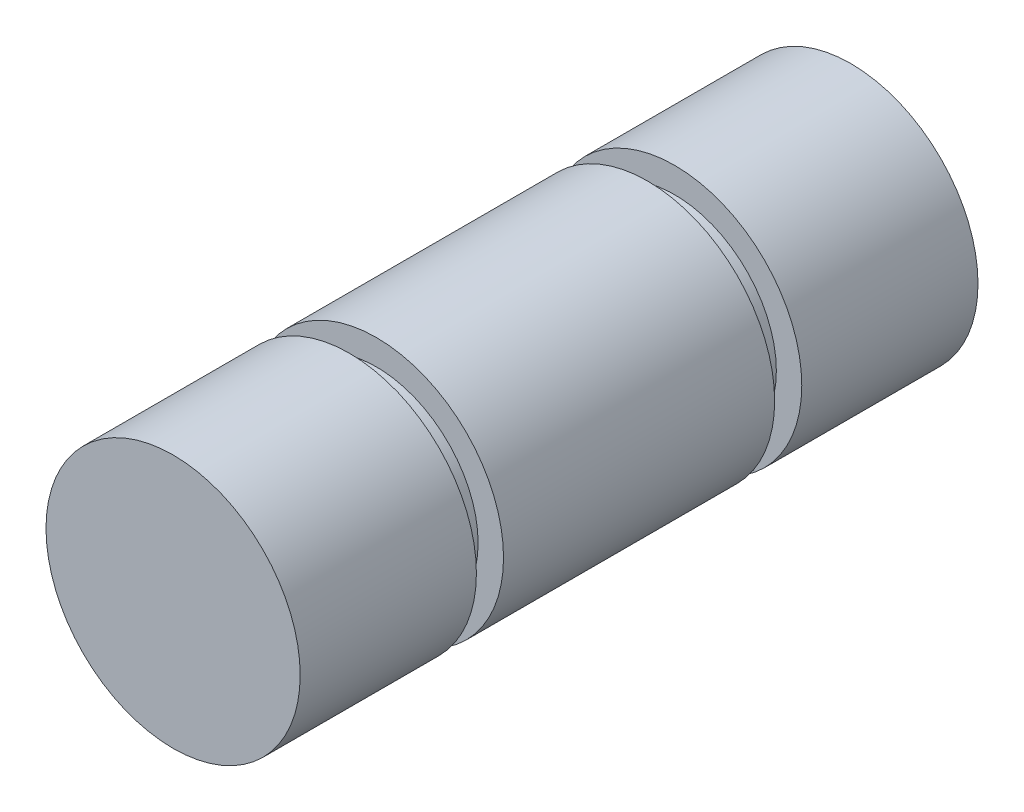
ISO-10303-21;
HEADER;
FILE_DESCRIPTION(('STEP AP214'),'2;1');
FILE_NAME('part.step','',(''),(''),'','','');
FILE_SCHEMA(('AUTOMOTIVE_DESIGN { 1 0 10303 214 1 1 1 1 }'));
ENDSEC;
DATA;
#1=APPLICATION_CONTEXT('core data for automotive mechanical design processes');
#2=APPLICATION_PROTOCOL_DEFINITION('international standard','automotive_design',2000,#1);
#3=PRODUCT_CONTEXT('',#1,'mechanical');
#4=PRODUCT('Part','Part','',(#3));
#5=PRODUCT_RELATED_PRODUCT_CATEGORY('part','',(#4));
#6=PRODUCT_DEFINITION_FORMATION('','',#4);
#7=PRODUCT_DEFINITION_CONTEXT('part definition',#1,'design');
#8=PRODUCT_DEFINITION('design','',#6,#7);
#9=PRODUCT_DEFINITION_SHAPE('','',#8);
#10=(LENGTH_UNIT() NAMED_UNIT(*) SI_UNIT(.MILLI.,.METRE.));
#11=(NAMED_UNIT(*) PLANE_ANGLE_UNIT() SI_UNIT($,.RADIAN.));
#12=(NAMED_UNIT(*) SI_UNIT($,.STERADIAN.) SOLID_ANGLE_UNIT());
#13=UNCERTAINTY_MEASURE_WITH_UNIT(LENGTH_MEASURE(1.E-05),#10,'distance_accuracy_value','');
#14=(GEOMETRIC_REPRESENTATION_CONTEXT(3) GLOBAL_UNCERTAINTY_ASSIGNED_CONTEXT((#13)) GLOBAL_UNIT_ASSIGNED_CONTEXT((#10,
#11,#12)) REPRESENTATION_CONTEXT('',''));
#15=CARTESIAN_POINT('',(0.,0.,0.));
#16=DIRECTION('',(0.,0.,1.));
#17=DIRECTION('',(1.,0.,0.));
#18=AXIS2_PLACEMENT_3D('',#15,#16,#17);
#19=CARTESIAN_POINT('',(0.,0.,12.7));
#20=DIRECTION('',(0.,0.,-1.));
#21=DIRECTION('',(-1.,0.,0.));
#22=AXIS2_PLACEMENT_3D('',#19,#20,#21);
#23=CYLINDRICAL_SURFACE('',#22,4.7625);
#24=CARTESIAN_POINT('',(0.,0.,-6.096));
#25=DIRECTION('',(0.,0.,1.));
#26=DIRECTION('',(1.,0.,0.));
#27=AXIS2_PLACEMENT_3D('',#24,#25,#26);
#28=CIRCLE('',#27,4.7625);
#29=CARTESIAN_POINT('',(4.7625,0.,-6.096));
#30=VERTEX_POINT('',#29);
#31=EDGE_CURVE('E56',#30,#30,#28,.T.);
#32=ORIENTED_EDGE('',*,*,#31,.F.);
#33=EDGE_LOOP('',(#32));
#34=FACE_BOUND('',#33,.T.);
#35=CARTESIAN_POINT('',(0.,0.,-12.7));
#36=DIRECTION('',(0.,0.,1.));
#37=DIRECTION('',(1.,0.,0.));
#38=AXIS2_PLACEMENT_3D('',#35,#36,#37);
#39=CIRCLE('',#38,4.7625);
#40=CARTESIAN_POINT('',(4.7625,0.,-12.7));
#41=VERTEX_POINT('',#40);
#42=EDGE_CURVE('E44',#41,#41,#39,.T.);
#43=ORIENTED_EDGE('',*,*,#42,.T.);
#44=EDGE_LOOP('',(#43));
#45=FACE_BOUND('',#44,.T.);
#46=ADVANCED_FACE('F41',(#34,#45),#23,.T.);
#47=CARTESIAN_POINT('',(0.,0.,-12.7));
#48=DIRECTION('',(0.,0.,1.));
#49=DIRECTION('',(1.,0.,0.));
#50=AXIS2_PLACEMENT_3D('',#47,#48,#49);
#51=PLANE('',#50);
#52=ORIENTED_EDGE('',*,*,#42,.F.);
#53=EDGE_LOOP('',(#52));
#54=FACE_BOUND('',#53,.T.);
#55=ADVANCED_FACE('F81',(#54),#51,.F.);
#56=CARTESIAN_POINT('',(4.7625,0.,-5.08));
#57=DIRECTION('',(0.,0.,1.));
#58=DIRECTION('',(1.,0.,0.));
#59=AXIS2_PLACEMENT_3D('',#56,#57,#58);
#60=PLANE('',#59);
#61=CARTESIAN_POINT('',(0.,0.,-5.08));
#62=DIRECTION('',(0.,0.,1.));
#63=DIRECTION('',(1.,0.,0.));
#64=AXIS2_PLACEMENT_3D('',#61,#62,#63);
#65=CIRCLE('',#64,4.7625);
#66=CARTESIAN_POINT('',(4.7625,0.,-5.08));
#67=VERTEX_POINT('',#66);
#68=EDGE_CURVE('E51',#67,#67,#65,.T.);
#69=ORIENTED_EDGE('',*,*,#68,.F.);
#70=EDGE_LOOP('',(#69));
#71=FACE_BOUND('',#70,.T.);
#72=CARTESIAN_POINT('',(0.,0.,-5.08));
#73=DIRECTION('',(0.,0.,1.));
#74=DIRECTION('',(1.,0.,0.));
#75=AXIS2_PLACEMENT_3D('',#72,#73,#74);
#76=CIRCLE('',#75,3.81);
#77=CARTESIAN_POINT('',(3.81,0.,-5.08));
#78=VERTEX_POINT('',#77);
#79=EDGE_CURVE('E68',#78,#78,#76,.T.);
#80=ORIENTED_EDGE('',*,*,#79,.T.);
#81=EDGE_LOOP('',(#80));
#82=FACE_BOUND('',#81,.T.);
#83=ADVANCED_FACE('F87',(#71,#82),#60,.F.);
#84=CARTESIAN_POINT('',(0.,0.,12.7));
#85=DIRECTION('',(0.,0.,1.));
#86=DIRECTION('',(1.,0.,0.));
#87=AXIS2_PLACEMENT_3D('',#84,#85,#86);
#88=CYLINDRICAL_SURFACE('',#87,3.81);
#89=ORIENTED_EDGE('',*,*,#79,.F.);
#90=EDGE_LOOP('',(#89));
#91=FACE_BOUND('',#90,.T.);
#92=CARTESIAN_POINT('',(0.,0.,-6.096));
#93=DIRECTION('',(0.,0.,1.));
#94=DIRECTION('',(1.,0.,0.));
#95=AXIS2_PLACEMENT_3D('',#92,#93,#94);
#96=CIRCLE('',#95,3.81);
#97=CARTESIAN_POINT('',(3.81,0.,-6.096));
#98=VERTEX_POINT('',#97);
#99=EDGE_CURVE('E71',#98,#98,#96,.T.);
#100=ORIENTED_EDGE('',*,*,#99,.T.);
#101=EDGE_LOOP('',(#100));
#102=FACE_BOUND('',#101,.T.);
#103=ADVANCED_FACE('F92',(#91,#102),#88,.T.);
#104=CARTESIAN_POINT('',(4.7625,0.,-6.096));
#105=DIRECTION('',(0.,0.,-1.));
#106=DIRECTION('',(-1.,0.,0.));
#107=AXIS2_PLACEMENT_3D('',#104,#105,#106);
#108=PLANE('',#107);
#109=ORIENTED_EDGE('',*,*,#99,.F.);
#110=EDGE_LOOP('',(#109));
#111=FACE_BOUND('',#110,.T.);
#112=ORIENTED_EDGE('',*,*,#31,.T.);
#113=EDGE_LOOP('',(#112));
#114=FACE_BOUND('',#113,.T.);
#115=ADVANCED_FACE('F77',(#111,#114),#108,.F.);
#116=ORIENTED_EDGE('',*,*,#68,.T.);
#117=EDGE_LOOP('',(#116));
#118=FACE_BOUND('',#117,.T.);
#119=CARTESIAN_POINT('',(0.,0.,5.08));
#120=DIRECTION('',(0.,0.,1.));
#121=DIRECTION('',(1.,0.,0.));
#122=AXIS2_PLACEMENT_3D('',#119,#120,#121);
#123=CIRCLE('',#122,4.7625);
#124=CARTESIAN_POINT('',(4.7625,0.,5.08));
#125=VERTEX_POINT('',#124);
#126=EDGE_CURVE('E63',#125,#125,#123,.T.);
#127=ORIENTED_EDGE('',*,*,#126,.F.);
#128=EDGE_LOOP('',(#127));
#129=FACE_BOUND('',#128,.T.);
#130=ADVANCED_FACE('F82',(#118,#129),#23,.T.);
#131=CARTESIAN_POINT('',(4.7625,0.,6.096));
#132=DIRECTION('',(0.,0.,1.));
#133=DIRECTION('',(1.,0.,0.));
#134=AXIS2_PLACEMENT_3D('',#131,#132,#133);
#135=PLANE('',#134);
#136=CARTESIAN_POINT('',(0.,0.,6.096));
#137=DIRECTION('',(0.,0.,1.));
#138=DIRECTION('',(1.,0.,0.));
#139=AXIS2_PLACEMENT_3D('',#136,#137,#138);
#140=CIRCLE('',#139,4.7625);
#141=CARTESIAN_POINT('',(4.7625,0.,6.096));
#142=VERTEX_POINT('',#141);
#143=EDGE_CURVE('E53',#142,#142,#140,.T.);
#144=ORIENTED_EDGE('',*,*,#143,.F.);
#145=EDGE_LOOP('',(#144));
#146=FACE_BOUND('',#145,.T.);
#147=CARTESIAN_POINT('',(0.,0.,6.096));
#148=DIRECTION('',(0.,0.,1.));
#149=DIRECTION('',(1.,0.,0.));
#150=AXIS2_PLACEMENT_3D('',#147,#148,#149);
#151=CIRCLE('',#150,3.81);
#152=CARTESIAN_POINT('',(3.81,0.,6.096));
#153=VERTEX_POINT('',#152);
#154=EDGE_CURVE('E57',#153,#153,#151,.T.);
#155=ORIENTED_EDGE('',*,*,#154,.T.);
#156=EDGE_LOOP('',(#155));
#157=FACE_BOUND('',#156,.T.);
#158=ADVANCED_FACE('F99',(#146,#157),#135,.F.);
#159=CARTESIAN_POINT('',(0.,0.,12.7));
#160=DIRECTION('',(0.,0.,1.));
#161=DIRECTION('',(1.,0.,0.));
#162=AXIS2_PLACEMENT_3D('',#159,#160,#161);
#163=CYLINDRICAL_SURFACE('',#162,3.81);
#164=ORIENTED_EDGE('',*,*,#154,.F.);
#165=EDGE_LOOP('',(#164));
#166=FACE_BOUND('',#165,.T.);
#167=CARTESIAN_POINT('',(0.,0.,5.08));
#168=DIRECTION('',(0.,0.,1.));
#169=DIRECTION('',(1.,0.,0.));
#170=AXIS2_PLACEMENT_3D('',#167,#168,#169);
#171=CIRCLE('',#170,3.81);
#172=CARTESIAN_POINT('',(3.81,0.,5.08));
#173=VERTEX_POINT('',#172);
#174=EDGE_CURVE('E60',#173,#173,#171,.T.);
#175=ORIENTED_EDGE('',*,*,#174,.T.);
#176=EDGE_LOOP('',(#175));
#177=FACE_BOUND('',#176,.T.);
#178=ADVANCED_FACE('F102',(#166,#177),#163,.T.);
#179=CARTESIAN_POINT('',(4.7625,0.,5.08));
#180=DIRECTION('',(0.,0.,-1.));
#181=DIRECTION('',(-1.,0.,0.));
#182=AXIS2_PLACEMENT_3D('',#179,#180,#181);
#183=PLANE('',#182);
#184=ORIENTED_EDGE('',*,*,#174,.F.);
#185=EDGE_LOOP('',(#184));
#186=FACE_BOUND('',#185,.T.);
#187=ORIENTED_EDGE('',*,*,#126,.T.);
#188=EDGE_LOOP('',(#187));
#189=FACE_BOUND('',#188,.T.);
#190=ADVANCED_FACE('F98',(#186,#189),#183,.F.);
#191=CARTESIAN_POINT('',(0.,0.,12.7));
#192=DIRECTION('',(0.,0.,1.));
#193=DIRECTION('',(1.,0.,0.));
#194=AXIS2_PLACEMENT_3D('',#191,#192,#193);
#195=PLANE('',#194);
#196=CARTESIAN_POINT('',(0.,0.,12.7));
#197=DIRECTION('',(0.,0.,1.));
#198=DIRECTION('',(1.,0.,0.));
#199=AXIS2_PLACEMENT_3D('',#196,#197,#198);
#200=CIRCLE('',#199,4.7625);
#201=CARTESIAN_POINT('',(4.7625,0.,12.7));
#202=VERTEX_POINT('',#201);
#203=EDGE_CURVE('E10',#202,#202,#200,.T.);
#204=ORIENTED_EDGE('',*,*,#203,.T.);
#205=EDGE_LOOP('',(#204));
#206=FACE_BOUND('',#205,.T.);
#207=ADVANCED_FACE('F96',(#206),#195,.T.);
#208=ORIENTED_EDGE('',*,*,#143,.T.);
#209=EDGE_LOOP('',(#208));
#210=FACE_BOUND('',#209,.T.);
#211=ORIENTED_EDGE('',*,*,#203,.F.);
#212=EDGE_LOOP('',(#211));
#213=FACE_BOUND('',#212,.T.);
#214=ADVANCED_FACE('F83',(#210,#213),#23,.T.);
#215=CLOSED_SHELL('',(#46,#55,#83,#103,#115,#130,#158,#178,#190,#207,#214));
#216=MANIFOLD_SOLID_BREP('B2',#215);
#217=ADVANCED_BREP_SHAPE_REPRESENTATION('',(#18,#216),#14);
#218=SHAPE_DEFINITION_REPRESENTATION(#9,#217);
ENDSEC;
END-ISO-10303-21;
